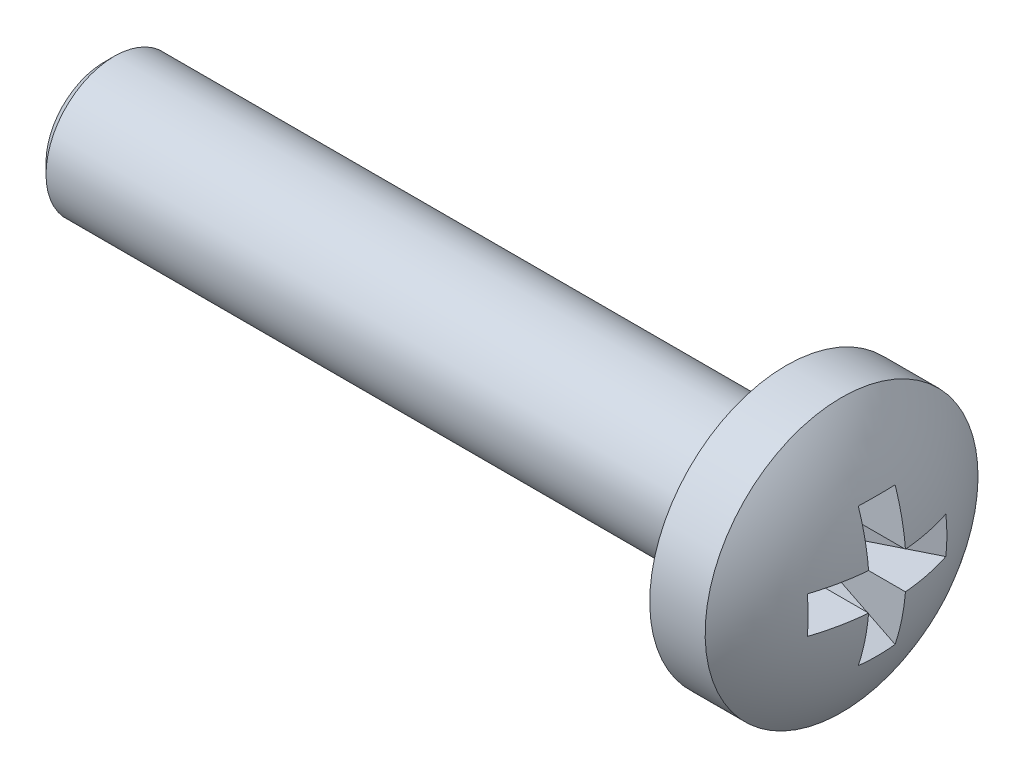
ISO-10303-21;
HEADER;
FILE_DESCRIPTION(('STEP AP214'),'2;1');
FILE_NAME('part.step','',(''),(''),'','','');
FILE_SCHEMA(('AUTOMOTIVE_DESIGN { 1 0 10303 214 1 1 1 1 }'));
ENDSEC;
DATA;
#1=APPLICATION_CONTEXT('core data for automotive mechanical design processes');
#2=APPLICATION_PROTOCOL_DEFINITION('international standard','automotive_design',2000,#1);
#3=PRODUCT_CONTEXT('',#1,'mechanical');
#4=PRODUCT('Part','Part','',(#3));
#5=PRODUCT_RELATED_PRODUCT_CATEGORY('part','',(#4));
#6=PRODUCT_DEFINITION_FORMATION('','',#4);
#7=PRODUCT_DEFINITION_CONTEXT('part definition',#1,'design');
#8=PRODUCT_DEFINITION('design','',#6,#7);
#9=PRODUCT_DEFINITION_SHAPE('','',#8);
#10=(LENGTH_UNIT() NAMED_UNIT(*) SI_UNIT(.MILLI.,.METRE.));
#11=(NAMED_UNIT(*) PLANE_ANGLE_UNIT() SI_UNIT($,.RADIAN.));
#12=(NAMED_UNIT(*) SI_UNIT($,.STERADIAN.) SOLID_ANGLE_UNIT());
#13=UNCERTAINTY_MEASURE_WITH_UNIT(LENGTH_MEASURE(1.E-05),#10,'distance_accuracy_value','');
#14=(GEOMETRIC_REPRESENTATION_CONTEXT(3) GLOBAL_UNCERTAINTY_ASSIGNED_CONTEXT((#13)) GLOBAL_UNIT_ASSIGNED_CONTEXT((#10,
#11,#12)) REPRESENTATION_CONTEXT('',''));
#15=CARTESIAN_POINT('',(0.,0.,0.));
#16=DIRECTION('',(0.,0.,1.));
#17=DIRECTION('',(1.,0.,0.));
#18=AXIS2_PLACEMENT_3D('',#15,#16,#17);
#19=CARTESIAN_POINT('',(-13.,0.,0.));
#20=DIRECTION('',(1.,0.,0.));
#21=DIRECTION('',(0.,-1.,0.));
#22=AXIS2_PLACEMENT_3D('',#19,#20,#21);
#23=SPHERICAL_SURFACE('',#22,13.);
#24=CARTESIAN_POINT('',(-12.1687957725923,0.,-1.66713776437291));
#25=DIRECTION('',(0.446197813109809,0.,-0.894934361602025));
#26=DIRECTION('',(-0.894934361602025,0.,-0.446197813109809));
#27=AXIS2_PLACEMENT_3D('',#24,#25,#26);
#28=CIRCLE('',#27,12.8658365918016);
#29=CARTESIAN_POINT('',(-0.695355024087683,1.08,4.05330877392233));
#30=VERTEX_POINT('',#29);
#31=CARTESIAN_POINT('',(-0.695355024087683,-1.08,4.05330877392233));
#32=VERTEX_POINT('',#31);
#33=EDGE_CURVE('E195',#30,#32,#28,.T.);
#34=ORIENTED_EDGE('',*,*,#33,.F.);
#35=CARTESIAN_POINT('',(-13.,1.08,0.));
#36=DIRECTION('',(0.,-1.,0.));
#37=DIRECTION('',(0.,0.,-1.));
#38=AXIS2_PLACEMENT_3D('',#35,#36,#37);
#39=CIRCLE('',#38,12.9550607871982);
#40=CARTESIAN_POINT('',(-0.0900348567472922,1.08,1.08));
#41=VERTEX_POINT('',#40);
#42=EDGE_CURVE('E114',#30,#41,#39,.F.);
#43=ORIENTED_EDGE('',*,*,#42,.T.);
#44=CARTESIAN_POINT('',(-13.,0.,1.08));
#45=DIRECTION('',(0.,0.,1.));
#46=DIRECTION('',(0.,-1.,0.));
#47=AXIS2_PLACEMENT_3D('',#44,#45,#46);
#48=CIRCLE('',#47,12.9550607871982);
#49=CARTESIAN_POINT('',(-0.695355024087685,4.05330877392233,1.08));
#50=VERTEX_POINT('',#49);
#51=EDGE_CURVE('E146',#50,#41,#48,.F.);
#52=ORIENTED_EDGE('',*,*,#51,.F.);
#53=CARTESIAN_POINT('',(-12.1687957725923,-1.66713776437291,0.));
#54=DIRECTION('',(0.446197813109809,-0.894934361602025,0.));
#55=DIRECTION('',(0.894934361602025,0.446197813109809,0.));
#56=AXIS2_PLACEMENT_3D('',#53,#54,#55);
#57=CIRCLE('',#56,12.8658365918016);
#58=CARTESIAN_POINT('',(-0.695355024087685,4.05330877392233,-1.08));
#59=VERTEX_POINT('',#58);
#60=EDGE_CURVE('E143',#50,#59,#57,.F.);
#61=ORIENTED_EDGE('',*,*,#60,.T.);
#62=CARTESIAN_POINT('',(-13.,0.,-1.08));
#63=DIRECTION('',(0.,0.,1.));
#64=DIRECTION('',(0.,-1.,0.));
#65=AXIS2_PLACEMENT_3D('',#62,#63,#64);
#66=CIRCLE('',#65,12.9550607871982);
#67=CARTESIAN_POINT('',(-0.0900348567472922,1.08,-1.08));
#68=VERTEX_POINT('',#67);
#69=EDGE_CURVE('E147',#59,#68,#66,.F.);
#70=ORIENTED_EDGE('',*,*,#69,.T.);
#71=CARTESIAN_POINT('',(-13.,1.08,0.));
#72=DIRECTION('',(0.,-1.,0.));
#73=DIRECTION('',(0.,0.,-1.));
#74=AXIS2_PLACEMENT_3D('',#71,#72,#73);
#75=CIRCLE('',#74,12.9550607871982);
#76=CARTESIAN_POINT('',(-0.695355024087685,1.08,-4.05330877392233));
#77=VERTEX_POINT('',#76);
#78=EDGE_CURVE('E197',#68,#77,#75,.F.);
#79=ORIENTED_EDGE('',*,*,#78,.T.);
#80=CARTESIAN_POINT('',(-12.1687957725923,0.,1.66713776437291));
#81=DIRECTION('',(0.446197813109809,0.,0.894934361602025));
#82=DIRECTION('',(0.894934361602025,0.,-0.446197813109809));
#83=AXIS2_PLACEMENT_3D('',#80,#81,#82);
#84=CIRCLE('',#83,12.8658365918016);
#85=CARTESIAN_POINT('',(-0.695355024087685,-1.08,-4.05330877392233));
#86=VERTEX_POINT('',#85);
#87=EDGE_CURVE('E200',#77,#86,#84,.F.);
#88=ORIENTED_EDGE('',*,*,#87,.T.);
#89=CARTESIAN_POINT('',(-13.,-1.08,0.));
#90=DIRECTION('',(0.,-1.,0.));
#91=DIRECTION('',(0.,0.,-1.));
#92=AXIS2_PLACEMENT_3D('',#89,#90,#91);
#93=CIRCLE('',#92,12.9550607871982);
#94=CARTESIAN_POINT('',(-0.0900348567472922,-1.08,-1.08));
#95=VERTEX_POINT('',#94);
#96=EDGE_CURVE('E201',#95,#86,#93,.F.);
#97=ORIENTED_EDGE('',*,*,#96,.F.);
#98=CARTESIAN_POINT('',(-13.,0.,-1.08));
#99=DIRECTION('',(0.,0.,1.));
#100=DIRECTION('',(0.,-1.,0.));
#101=AXIS2_PLACEMENT_3D('',#98,#99,#100);
#102=CIRCLE('',#101,12.9550607871982);
#103=CARTESIAN_POINT('',(-0.695355024087683,-4.05330877392233,-1.08));
#104=VERTEX_POINT('',#103);
#105=EDGE_CURVE('E157',#95,#104,#102,.F.);
#106=ORIENTED_EDGE('',*,*,#105,.T.);
#107=CARTESIAN_POINT('',(-12.1687957725923,1.66713776437291,0.));
#108=DIRECTION('',(0.446197813109809,0.894934361602025,0.));
#109=DIRECTION('',(-0.894934361602025,0.446197813109809,0.));
#110=AXIS2_PLACEMENT_3D('',#107,#108,#109);
#111=CIRCLE('',#110,12.8658365918016);
#112=CARTESIAN_POINT('',(-0.695355024087683,-4.05330877392233,1.08));
#113=VERTEX_POINT('',#112);
#114=EDGE_CURVE('E154',#113,#104,#111,.T.);
#115=ORIENTED_EDGE('',*,*,#114,.F.);
#116=CARTESIAN_POINT('',(-13.,0.,1.08));
#117=DIRECTION('',(0.,0.,1.));
#118=DIRECTION('',(0.,-1.,0.));
#119=AXIS2_PLACEMENT_3D('',#116,#117,#118);
#120=CIRCLE('',#119,12.9550607871982);
#121=CARTESIAN_POINT('',(-0.0900348567472922,-1.08,1.08));
#122=VERTEX_POINT('',#121);
#123=EDGE_CURVE('E158',#122,#113,#120,.F.);
#124=ORIENTED_EDGE('',*,*,#123,.F.);
#125=CARTESIAN_POINT('',(-13.,-1.08,0.));
#126=DIRECTION('',(0.,-1.,0.));
#127=DIRECTION('',(0.,0.,-1.));
#128=AXIS2_PLACEMENT_3D('',#125,#126,#127);
#129=CIRCLE('',#128,12.9550607871982);
#130=EDGE_CURVE('E193',#32,#122,#129,.F.);
#131=ORIENTED_EDGE('',*,*,#130,.F.);
#132=EDGE_LOOP('',(#34,#43,#52,#61,#70,#79,#88,#97,#106,#115,#124,#131));
#133=FACE_BOUND('',#132,.T.);
#134=CARTESIAN_POINT('',(-2.75304923404041,0.,0.));
#135=DIRECTION('',(1.,0.,0.));
#136=DIRECTION('',(0.,1.,0.));
#137=AXIS2_PLACEMENT_3D('',#134,#135,#136);
#138=CIRCLE('',#137,8.);
#139=CARTESIAN_POINT('',(-2.75304923404041,8.,0.));
#140=VERTEX_POINT('',#139);
#141=EDGE_CURVE('E118',#140,#140,#138,.T.);
#142=ORIENTED_EDGE('',*,*,#141,.T.);
#143=EDGE_LOOP('',(#142));
#144=FACE_BOUND('',#143,.T.);
#145=ADVANCED_FACE('F16',(#133,#144),#23,.T.);
#146=CARTESIAN_POINT('',(-46.,0.,0.));
#147=DIRECTION('',(-1.,0.,0.));
#148=DIRECTION('',(0.,-1.,0.));
#149=AXIS2_PLACEMENT_3D('',#146,#147,#148);
#150=PLANE('',#149);
#151=CARTESIAN_POINT('',(-46.,0.,0.));
#152=DIRECTION('',(-1.,0.,0.));
#153=DIRECTION('',(0.,-1.,0.));
#154=AXIS2_PLACEMENT_3D('',#151,#152,#153);
#155=CIRCLE('',#154,3.4);
#156=CARTESIAN_POINT('',(-46.,-3.40000000000001,0.));
#157=VERTEX_POINT('',#156);
#158=EDGE_CURVE('E10',#157,#157,#155,.T.);
#159=ORIENTED_EDGE('',*,*,#158,.T.);
#160=EDGE_LOOP('',(#159));
#161=FACE_BOUND('',#160,.T.);
#162=ADVANCED_FACE('F262',(#161),#150,.T.);
#163=CARTESIAN_POINT('',(0.,0.,0.));
#164=DIRECTION('',(1.,0.,0.));
#165=DIRECTION('',(0.,1.,0.));
#166=AXIS2_PLACEMENT_3D('',#163,#164,#165);
#167=CYLINDRICAL_SURFACE('',#166,4.);
#168=CARTESIAN_POINT('',(-45.4,0.,0.));
#169=DIRECTION('',(-1.,0.,0.));
#170=DIRECTION('',(0.,-1.,0.));
#171=AXIS2_PLACEMENT_3D('',#168,#169,#170);
#172=CIRCLE('',#171,4.);
#173=CARTESIAN_POINT('',(-45.4,-4.00000000000001,0.));
#174=VERTEX_POINT('',#173);
#175=EDGE_CURVE('E26',#174,#174,#172,.F.);
#176=ORIENTED_EDGE('',*,*,#175,.T.);
#177=EDGE_LOOP('',(#176));
#178=FACE_BOUND('',#177,.T.);
#179=CARTESIAN_POINT('',(-6.,0.,0.));
#180=DIRECTION('',(1.,0.,0.));
#181=DIRECTION('',(0.,1.,0.));
#182=AXIS2_PLACEMENT_3D('',#179,#180,#181);
#183=CIRCLE('',#182,4.);
#184=CARTESIAN_POINT('',(-6.,4.,0.));
#185=VERTEX_POINT('',#184);
#186=EDGE_CURVE('E190',#185,#185,#183,.T.);
#187=ORIENTED_EDGE('',*,*,#186,.F.);
#188=EDGE_LOOP('',(#187));
#189=FACE_BOUND('',#188,.T.);
#190=ADVANCED_FACE('F268',(#178,#189),#167,.T.);
#191=CARTESIAN_POINT('',(-6.,4.,0.));
#192=DIRECTION('',(-1.,0.,0.));
#193=DIRECTION('',(0.,-1.,0.));
#194=AXIS2_PLACEMENT_3D('',#191,#192,#193);
#195=PLANE('',#194);
#196=ORIENTED_EDGE('',*,*,#186,.T.);
#197=EDGE_LOOP('',(#196));
#198=FACE_BOUND('',#197,.T.);
#199=CARTESIAN_POINT('',(-6.,0.,0.));
#200=DIRECTION('',(1.,0.,0.));
#201=DIRECTION('',(0.,1.,0.));
#202=AXIS2_PLACEMENT_3D('',#199,#200,#201);
#203=CIRCLE('',#202,8.);
#204=CARTESIAN_POINT('',(-6.,8.,0.));
#205=VERTEX_POINT('',#204);
#206=EDGE_CURVE('E187',#205,#205,#203,.T.);
#207=ORIENTED_EDGE('',*,*,#206,.F.);
#208=EDGE_LOOP('',(#207));
#209=FACE_BOUND('',#208,.T.);
#210=ADVANCED_FACE('F299',(#198,#209),#195,.T.);
#211=CARTESIAN_POINT('',(0.,0.,0.));
#212=DIRECTION('',(1.,0.,0.));
#213=DIRECTION('',(0.,1.,0.));
#214=AXIS2_PLACEMENT_3D('',#211,#212,#213);
#215=CYLINDRICAL_SURFACE('',#214,8.);
#216=ORIENTED_EDGE('',*,*,#206,.T.);
#217=EDGE_LOOP('',(#216));
#218=FACE_BOUND('',#217,.T.);
#219=ORIENTED_EDGE('',*,*,#141,.F.);
#220=EDGE_LOOP('',(#219));
#221=FACE_BOUND('',#220,.T.);
#222=ADVANCED_FACE('F296',(#218,#221),#215,.T.);
#223=CARTESIAN_POINT('',(0.,0.,4.4));
#224=DIRECTION('',(0.446197813109809,0.,-0.894934361602025));
#225=DIRECTION('',(-0.894934361602025,0.,-0.446197813109809));
#226=AXIS2_PLACEMENT_3D('',#223,#224,#225);
#227=PLANE('',#226);
#228=ORIENTED_EDGE('',*,*,#33,.T.);
#229=DIRECTION('',(-0.894934361602025,0.,-0.446197813109809));
#230=VECTOR('',#229,1.);
#231=CARTESIAN_POINT('',(0.,-1.08,4.4));
#232=LINE('',#231,#230);
#233=CARTESIAN_POINT('',(-4.5,-1.08,2.15638276375955));
#234=VERTEX_POINT('',#233);
#235=EDGE_CURVE('E35',#234,#32,#232,.F.);
#236=ORIENTED_EDGE('',*,*,#235,.F.);
#237=DIRECTION('',(0.,1.,0.));
#238=VECTOR('',#237,1.);
#239=CARTESIAN_POINT('',(-4.5,0.,2.15638276375955));
#240=LINE('',#239,#238);
#241=CARTESIAN_POINT('',(-4.5,1.08,2.15638276375955));
#242=VERTEX_POINT('',#241);
#243=EDGE_CURVE('E126',#242,#234,#240,.F.);
#244=ORIENTED_EDGE('',*,*,#243,.F.);
#245=DIRECTION('',(-0.894934361602025,0.,-0.446197813109809));
#246=VECTOR('',#245,1.);
#247=CARTESIAN_POINT('',(0.,1.08,4.4));
#248=LINE('',#247,#246);
#249=EDGE_CURVE('E107',#242,#30,#248,.F.);
#250=ORIENTED_EDGE('',*,*,#249,.T.);
#251=EDGE_LOOP('',(#228,#236,#244,#250));
#252=FACE_BOUND('',#251,.T.);
#253=ADVANCED_FACE('F18',(#252),#227,.T.);
#254=CARTESIAN_POINT('',(-4.5,1.08,0.));
#255=DIRECTION('',(0.,-1.,0.));
#256=DIRECTION('',(0.,0.,-1.));
#257=AXIS2_PLACEMENT_3D('',#254,#255,#256);
#258=PLANE('',#257);
#259=ORIENTED_EDGE('',*,*,#249,.F.);
#260=DIRECTION('',(0.,0.,-1.));
#261=VECTOR('',#260,1.);
#262=CARTESIAN_POINT('',(-4.5,1.08,0.));
#263=LINE('',#262,#261);
#264=CARTESIAN_POINT('',(-4.5,1.08,1.08));
#265=VERTEX_POINT('',#264);
#266=EDGE_CURVE('E111',#242,#265,#263,.T.);
#267=ORIENTED_EDGE('',*,*,#266,.T.);
#268=DIRECTION('',(1.,0.,0.));
#269=VECTOR('',#268,1.);
#270=CARTESIAN_POINT('',(-4.5,1.08,1.08));
#271=LINE('',#270,#269);
#272=EDGE_CURVE('E119',#265,#41,#271,.T.);
#273=ORIENTED_EDGE('',*,*,#272,.T.);
#274=ORIENTED_EDGE('',*,*,#42,.F.);
#275=EDGE_LOOP('',(#259,#267,#273,#274));
#276=FACE_BOUND('',#275,.T.);
#277=ADVANCED_FACE('F109',(#276),#258,.T.);
#278=CARTESIAN_POINT('',(-4.5,0.,1.08));
#279=DIRECTION('',(0.,0.,1.));
#280=DIRECTION('',(0.,-1.,0.));
#281=AXIS2_PLACEMENT_3D('',#278,#279,#280);
#282=PLANE('',#281);
#283=ORIENTED_EDGE('',*,*,#51,.T.);
#284=ORIENTED_EDGE('',*,*,#272,.F.);
#285=DIRECTION('',(0.,-1.,0.));
#286=VECTOR('',#285,1.);
#287=CARTESIAN_POINT('',(-4.5,0.,1.08));
#288=LINE('',#287,#286);
#289=CARTESIAN_POINT('',(-4.5,2.15638276375956,1.08));
#290=VERTEX_POINT('',#289);
#291=EDGE_CURVE('E129',#290,#265,#288,.T.);
#292=ORIENTED_EDGE('',*,*,#291,.F.);
#293=DIRECTION('',(0.894934361602025,0.446197813109809,0.));
#294=VECTOR('',#293,1.);
#295=CARTESIAN_POINT('',(-5.36108192419615,1.72706315332809,1.08));
#296=LINE('',#295,#294);
#297=EDGE_CURVE('E139',#290,#50,#296,.T.);
#298=ORIENTED_EDGE('',*,*,#297,.T.);
#299=EDGE_LOOP('',(#283,#284,#292,#298));
#300=FACE_BOUND('',#299,.T.);
#301=ADVANCED_FACE('F250',(#300),#282,.F.);
#302=CARTESIAN_POINT('',(0.,4.4,0.));
#303=DIRECTION('',(0.446197813109809,-0.894934361602025,0.));
#304=DIRECTION('',(0.894934361602025,0.446197813109809,0.));
#305=AXIS2_PLACEMENT_3D('',#302,#303,#304);
#306=PLANE('',#305);
#307=ORIENTED_EDGE('',*,*,#297,.F.);
#308=DIRECTION('',(0.,0.,-1.));
#309=VECTOR('',#308,1.);
#310=CARTESIAN_POINT('',(-4.5,2.15638276375956,0.));
#311=LINE('',#310,#309);
#312=CARTESIAN_POINT('',(-4.5,2.15638276375956,-1.08));
#313=VERTEX_POINT('',#312);
#314=EDGE_CURVE('E151',#290,#313,#311,.T.);
#315=ORIENTED_EDGE('',*,*,#314,.T.);
#316=DIRECTION('',(0.894934361602025,0.446197813109809,0.));
#317=VECTOR('',#316,1.);
#318=CARTESIAN_POINT('',(-5.36108192419615,1.72706315332809,-1.08));
#319=LINE('',#318,#317);
#320=EDGE_CURVE('E142',#313,#59,#319,.T.);
#321=ORIENTED_EDGE('',*,*,#320,.T.);
#322=ORIENTED_EDGE('',*,*,#60,.F.);
#323=EDGE_LOOP('',(#307,#315,#321,#322));
#324=FACE_BOUND('',#323,.T.);
#325=ADVANCED_FACE('F248',(#324),#306,.T.);
#326=CARTESIAN_POINT('',(-4.5,0.,-1.08));
#327=DIRECTION('',(0.,0.,1.));
#328=DIRECTION('',(0.,-1.,0.));
#329=AXIS2_PLACEMENT_3D('',#326,#327,#328);
#330=PLANE('',#329);
#331=ORIENTED_EDGE('',*,*,#320,.F.);
#332=DIRECTION('',(0.,-1.,0.));
#333=VECTOR('',#332,1.);
#334=CARTESIAN_POINT('',(-4.5,0.,-1.08));
#335=LINE('',#334,#333);
#336=CARTESIAN_POINT('',(-4.5,1.08,-1.08));
#337=VERTEX_POINT('',#336);
#338=EDGE_CURVE('E153',#313,#337,#335,.T.);
#339=ORIENTED_EDGE('',*,*,#338,.T.);
#340=DIRECTION('',(1.,0.,0.));
#341=VECTOR('',#340,1.);
#342=CARTESIAN_POINT('',(-4.5,1.08,-1.08));
#343=LINE('',#342,#341);
#344=EDGE_CURVE('E150',#337,#68,#343,.T.);
#345=ORIENTED_EDGE('',*,*,#344,.T.);
#346=ORIENTED_EDGE('',*,*,#69,.F.);
#347=EDGE_LOOP('',(#331,#339,#345,#346));
#348=FACE_BOUND('',#347,.T.);
#349=ADVANCED_FACE('F245',(#348),#330,.T.);
#350=CARTESIAN_POINT('',(-4.5,1.08,0.));
#351=DIRECTION('',(0.,-1.,0.));
#352=DIRECTION('',(0.,0.,-1.));
#353=AXIS2_PLACEMENT_3D('',#350,#351,#352);
#354=PLANE('',#353);
#355=ORIENTED_EDGE('',*,*,#344,.F.);
#356=DIRECTION('',(0.,0.,-1.));
#357=VECTOR('',#356,1.);
#358=CARTESIAN_POINT('',(-4.5,1.08,0.));
#359=LINE('',#358,#357);
#360=CARTESIAN_POINT('',(-4.5,1.08,-2.15638276375956));
#361=VERTEX_POINT('',#360);
#362=EDGE_CURVE('E173',#337,#361,#359,.T.);
#363=ORIENTED_EDGE('',*,*,#362,.T.);
#364=DIRECTION('',(0.894934361602025,0.,-0.446197813109809));
#365=VECTOR('',#364,1.);
#366=CARTESIAN_POINT('',(0.,1.08,-4.4));
#367=LINE('',#366,#365);
#368=EDGE_CURVE('E180',#361,#77,#367,.T.);
#369=ORIENTED_EDGE('',*,*,#368,.T.);
#370=ORIENTED_EDGE('',*,*,#78,.F.);
#371=EDGE_LOOP('',(#355,#363,#369,#370));
#372=FACE_BOUND('',#371,.T.);
#373=ADVANCED_FACE('F242',(#372),#354,.T.);
#374=CARTESIAN_POINT('',(0.,0.,-4.4));
#375=DIRECTION('',(0.446197813109809,0.,0.894934361602025));
#376=DIRECTION('',(0.894934361602025,0.,-0.446197813109809));
#377=AXIS2_PLACEMENT_3D('',#374,#375,#376);
#378=PLANE('',#377);
#379=ORIENTED_EDGE('',*,*,#368,.F.);
#380=DIRECTION('',(0.,-1.,0.));
#381=VECTOR('',#380,1.);
#382=CARTESIAN_POINT('',(-4.5,0.,-2.15638276375956));
#383=LINE('',#382,#381);
#384=CARTESIAN_POINT('',(-4.5,-1.08,-2.15638276375956));
#385=VERTEX_POINT('',#384);
#386=EDGE_CURVE('E172',#361,#385,#383,.T.);
#387=ORIENTED_EDGE('',*,*,#386,.T.);
#388=DIRECTION('',(0.894934361602025,0.,-0.446197813109809));
#389=VECTOR('',#388,1.);
#390=CARTESIAN_POINT('',(0.,-1.08,-4.4));
#391=LINE('',#390,#389);
#392=EDGE_CURVE('E182',#385,#86,#391,.T.);
#393=ORIENTED_EDGE('',*,*,#392,.T.);
#394=ORIENTED_EDGE('',*,*,#87,.F.);
#395=EDGE_LOOP('',(#379,#387,#393,#394));
#396=FACE_BOUND('',#395,.T.);
#397=ADVANCED_FACE('F236',(#396),#378,.T.);
#398=CARTESIAN_POINT('',(-4.5,-1.08,0.));
#399=DIRECTION('',(0.,-1.,0.));
#400=DIRECTION('',(0.,0.,-1.));
#401=AXIS2_PLACEMENT_3D('',#398,#399,#400);
#402=PLANE('',#401);
#403=ORIENTED_EDGE('',*,*,#96,.T.);
#404=ORIENTED_EDGE('',*,*,#392,.F.);
#405=DIRECTION('',(0.,0.,-1.));
#406=VECTOR('',#405,1.);
#407=CARTESIAN_POINT('',(-4.5,-1.08,0.));
#408=LINE('',#407,#406);
#409=CARTESIAN_POINT('',(-4.5,-1.08,-1.08));
#410=VERTEX_POINT('',#409);
#411=EDGE_CURVE('E165',#410,#385,#408,.T.);
#412=ORIENTED_EDGE('',*,*,#411,.F.);
#413=DIRECTION('',(1.,0.,0.));
#414=VECTOR('',#413,1.);
#415=CARTESIAN_POINT('',(-4.5,-1.08,-1.08));
#416=LINE('',#415,#414);
#417=EDGE_CURVE('E79',#410,#95,#416,.T.);
#418=ORIENTED_EDGE('',*,*,#417,.T.);
#419=EDGE_LOOP('',(#403,#404,#412,#418));
#420=FACE_BOUND('',#419,.T.);
#421=ADVANCED_FACE('F232',(#420),#402,.F.);
#422=CARTESIAN_POINT('',(-4.5,0.,-1.08));
#423=DIRECTION('',(0.,0.,1.));
#424=DIRECTION('',(0.,-1.,0.));
#425=AXIS2_PLACEMENT_3D('',#422,#423,#424);
#426=PLANE('',#425);
#427=ORIENTED_EDGE('',*,*,#417,.F.);
#428=DIRECTION('',(0.,-1.,0.));
#429=VECTOR('',#428,1.);
#430=CARTESIAN_POINT('',(-4.5,0.,-1.08));
#431=LINE('',#430,#429);
#432=CARTESIAN_POINT('',(-4.5,-2.15638276375955,-1.08));
#433=VERTEX_POINT('',#432);
#434=EDGE_CURVE('E73',#410,#433,#431,.T.);
#435=ORIENTED_EDGE('',*,*,#434,.T.);
#436=DIRECTION('',(-0.894934361602025,0.446197813109809,0.));
#437=VECTOR('',#436,1.);
#438=CARTESIAN_POINT('',(-5.36108192419615,-1.72706315332809,-1.08));
#439=LINE('',#438,#437);
#440=EDGE_CURVE('E20',#433,#104,#439,.F.);
#441=ORIENTED_EDGE('',*,*,#440,.T.);
#442=ORIENTED_EDGE('',*,*,#105,.F.);
#443=EDGE_LOOP('',(#427,#435,#441,#442));
#444=FACE_BOUND('',#443,.T.);
#445=ADVANCED_FACE('F228',(#444),#426,.T.);
#446=CARTESIAN_POINT('',(0.,-4.4,0.));
#447=DIRECTION('',(0.446197813109809,0.894934361602025,0.));
#448=DIRECTION('',(-0.894934361602025,0.446197813109809,0.));
#449=AXIS2_PLACEMENT_3D('',#446,#447,#448);
#450=PLANE('',#449);
#451=ORIENTED_EDGE('',*,*,#114,.T.);
#452=ORIENTED_EDGE('',*,*,#440,.F.);
#453=DIRECTION('',(0.,0.,1.));
#454=VECTOR('',#453,1.);
#455=CARTESIAN_POINT('',(-4.5,-2.15638276375955,0.));
#456=LINE('',#455,#454);
#457=CARTESIAN_POINT('',(-4.5,-2.15638276375955,1.08));
#458=VERTEX_POINT('',#457);
#459=EDGE_CURVE('E161',#458,#433,#456,.F.);
#460=ORIENTED_EDGE('',*,*,#459,.F.);
#461=DIRECTION('',(-0.894934361602025,0.446197813109809,0.));
#462=VECTOR('',#461,1.);
#463=CARTESIAN_POINT('',(-5.36108192419615,-1.72706315332809,1.08));
#464=LINE('',#463,#462);
#465=EDGE_CURVE('E159',#458,#113,#464,.F.);
#466=ORIENTED_EDGE('',*,*,#465,.T.);
#467=EDGE_LOOP('',(#451,#452,#460,#466));
#468=FACE_BOUND('',#467,.T.);
#469=ADVANCED_FACE('F227',(#468),#450,.T.);
#470=CARTESIAN_POINT('',(-4.5,0.,1.08));
#471=DIRECTION('',(0.,0.,1.));
#472=DIRECTION('',(0.,-1.,0.));
#473=AXIS2_PLACEMENT_3D('',#470,#471,#472);
#474=PLANE('',#473);
#475=ORIENTED_EDGE('',*,*,#123,.T.);
#476=ORIENTED_EDGE('',*,*,#465,.F.);
#477=DIRECTION('',(0.,-1.,0.));
#478=VECTOR('',#477,1.);
#479=CARTESIAN_POINT('',(-4.5,0.,1.08));
#480=LINE('',#479,#478);
#481=CARTESIAN_POINT('',(-4.5,-1.08,1.08));
#482=VERTEX_POINT('',#481);
#483=EDGE_CURVE('E133',#482,#458,#480,.T.);
#484=ORIENTED_EDGE('',*,*,#483,.F.);
#485=DIRECTION('',(1.,0.,0.));
#486=VECTOR('',#485,1.);
#487=CARTESIAN_POINT('',(-4.5,-1.08,1.08));
#488=LINE('',#487,#486);
#489=EDGE_CURVE('E138',#482,#122,#488,.T.);
#490=ORIENTED_EDGE('',*,*,#489,.T.);
#491=EDGE_LOOP('',(#475,#476,#484,#490));
#492=FACE_BOUND('',#491,.T.);
#493=ADVANCED_FACE('F225',(#492),#474,.F.);
#494=CARTESIAN_POINT('',(-4.5,-1.08,0.));
#495=DIRECTION('',(0.,-1.,0.));
#496=DIRECTION('',(0.,0.,-1.));
#497=AXIS2_PLACEMENT_3D('',#494,#495,#496);
#498=PLANE('',#497);
#499=ORIENTED_EDGE('',*,*,#130,.T.);
#500=ORIENTED_EDGE('',*,*,#489,.F.);
#501=DIRECTION('',(0.,0.,-1.));
#502=VECTOR('',#501,1.);
#503=CARTESIAN_POINT('',(-4.5,-1.08,0.));
#504=LINE('',#503,#502);
#505=EDGE_CURVE('E131',#234,#482,#504,.T.);
#506=ORIENTED_EDGE('',*,*,#505,.F.);
#507=ORIENTED_EDGE('',*,*,#235,.T.);
#508=EDGE_LOOP('',(#499,#500,#506,#507));
#509=FACE_BOUND('',#508,.T.);
#510=ADVANCED_FACE('F223',(#509),#498,.F.);
#511=CARTESIAN_POINT('',(-4.5,0.,0.));
#512=DIRECTION('',(1.,0.,0.));
#513=DIRECTION('',(0.,0.,-1.));
#514=AXIS2_PLACEMENT_3D('',#511,#512,#513);
#515=PLANE('',#514);
#516=ORIENTED_EDGE('',*,*,#243,.T.);
#517=ORIENTED_EDGE('',*,*,#505,.T.);
#518=ORIENTED_EDGE('',*,*,#483,.T.);
#519=ORIENTED_EDGE('',*,*,#459,.T.);
#520=ORIENTED_EDGE('',*,*,#434,.F.);
#521=ORIENTED_EDGE('',*,*,#411,.T.);
#522=ORIENTED_EDGE('',*,*,#386,.F.);
#523=ORIENTED_EDGE('',*,*,#362,.F.);
#524=ORIENTED_EDGE('',*,*,#338,.F.);
#525=ORIENTED_EDGE('',*,*,#314,.F.);
#526=ORIENTED_EDGE('',*,*,#291,.T.);
#527=ORIENTED_EDGE('',*,*,#266,.F.);
#528=EDGE_LOOP('',(#516,#517,#518,#519,#520,#521,#522,#523,#524,#525,#526,#527));
#529=FACE_BOUND('',#528,.T.);
#530=ADVANCED_FACE('F124',(#529),#515,.T.);
#531=CARTESIAN_POINT('',(-45.4,0.,0.));
#532=DIRECTION('',(1.,0.,0.));
#533=DIRECTION('',(0.,1.,0.));
#534=AXIS2_PLACEMENT_3D('',#531,#532,#533);
#535=CONICAL_SURFACE('',#534,4.,0.785398163397443);
#536=ORIENTED_EDGE('',*,*,#158,.F.);
#537=EDGE_LOOP('',(#536));
#538=FACE_BOUND('',#537,.T.);
#539=ORIENTED_EDGE('',*,*,#175,.F.);
#540=EDGE_LOOP('',(#539));
#541=FACE_BOUND('',#540,.T.);
#542=ADVANCED_FACE('F273',(#538,#541),#535,.T.);
#543=CLOSED_SHELL('',(#145,#162,#190,#210,#222,#253,#277,#301,#325,#349,#373,#397,#421,#445,
#469,#493,#510,#530,#542));
#544=MANIFOLD_SOLID_BREP('B1',#543);
#545=ADVANCED_BREP_SHAPE_REPRESENTATION('',(#18,#544),#14);
#546=SHAPE_DEFINITION_REPRESENTATION(#9,#545);
ENDSEC;
END-ISO-10303-21;
